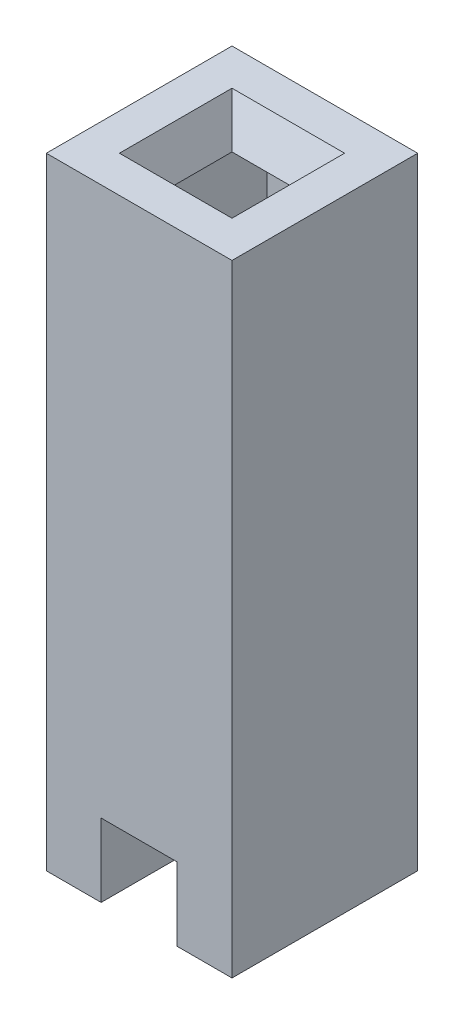
ISO-10303-21;
HEADER;
FILE_DESCRIPTION(('STEP AP214'),'2;1');
FILE_NAME('part.step','',(''),(''),'','','');
FILE_SCHEMA(('AUTOMOTIVE_DESIGN { 1 0 10303 214 1 1 1 1 }'));
ENDSEC;
DATA;
#1=APPLICATION_CONTEXT('core data for automotive mechanical design processes');
#2=APPLICATION_PROTOCOL_DEFINITION('international standard','automotive_design',2000,#1);
#3=PRODUCT_CONTEXT('',#1,'mechanical');
#4=PRODUCT('Part','Part','',(#3));
#5=PRODUCT_RELATED_PRODUCT_CATEGORY('part','',(#4));
#6=PRODUCT_DEFINITION_FORMATION('','',#4);
#7=PRODUCT_DEFINITION_CONTEXT('part definition',#1,'design');
#8=PRODUCT_DEFINITION('design','',#6,#7);
#9=PRODUCT_DEFINITION_SHAPE('','',#8);
#10=(LENGTH_UNIT() NAMED_UNIT(*) SI_UNIT(.MILLI.,.METRE.));
#11=(NAMED_UNIT(*) PLANE_ANGLE_UNIT() SI_UNIT($,.RADIAN.));
#12=(NAMED_UNIT(*) SI_UNIT($,.STERADIAN.) SOLID_ANGLE_UNIT());
#13=UNCERTAINTY_MEASURE_WITH_UNIT(LENGTH_MEASURE(1.E-05),#10,'distance_accuracy_value','');
#14=(GEOMETRIC_REPRESENTATION_CONTEXT(3) GLOBAL_UNCERTAINTY_ASSIGNED_CONTEXT((#13)) GLOBAL_UNIT_ASSIGNED_CONTEXT((#10,
#11,#12)) REPRESENTATION_CONTEXT('',''));
#15=CARTESIAN_POINT('',(0.,0.,0.));
#16=DIRECTION('',(0.,0.,1.));
#17=DIRECTION('',(1.,0.,0.));
#18=AXIS2_PLACEMENT_3D('',#15,#16,#17);
#19=CARTESIAN_POINT('',(-0.75,1.,2.54));
#20=DIRECTION('',(0.,1.,0.));
#21=DIRECTION('',(-1.,0.,0.));
#22=AXIS2_PLACEMENT_3D('',#19,#20,#21);
#23=PLANE('',#22);
#24=DIRECTION('',(0.,0.,-1.));
#25=VECTOR('',#24,1.);
#26=CARTESIAN_POINT('',(-1.79,1.,2.54));
#27=LINE('',#26,#25);
#28=CARTESIAN_POINT('',(-1.79,1.,2.54));
#29=VERTEX_POINT('',#28);
#30=CARTESIAN_POINT('',(-1.79,1.,2.27));
#31=VERTEX_POINT('',#30);
#32=EDGE_CURVE('E302',#29,#31,#27,.T.);
#33=ORIENTED_EDGE('',*,*,#32,.T.);
#34=DIRECTION('',(-1.,0.,0.));
#35=VECTOR('',#34,1.);
#36=CARTESIAN_POINT('',(-1.79,1.,2.27));
#37=LINE('',#36,#35);
#38=CARTESIAN_POINT('',(-0.75,1.,2.27));
#39=VERTEX_POINT('',#38);
#40=EDGE_CURVE('E220',#39,#31,#37,.T.);
#41=ORIENTED_EDGE('',*,*,#40,.F.);
#42=DIRECTION('',(0.,0.,-1.));
#43=VECTOR('',#42,1.);
#44=CARTESIAN_POINT('',(-0.75,1.,2.54));
#45=LINE('',#44,#43);
#46=CARTESIAN_POINT('',(-0.75,1.,2.54));
#47=VERTEX_POINT('',#46);
#48=EDGE_CURVE('E297',#47,#39,#45,.T.);
#49=ORIENTED_EDGE('',*,*,#48,.F.);
#50=DIRECTION('',(1.,0.,0.));
#51=VECTOR('',#50,1.);
#52=CARTESIAN_POINT('',(-0.75,1.,2.54));
#53=LINE('',#52,#51);
#54=EDGE_CURVE('E255',#29,#47,#53,.T.);
#55=ORIENTED_EDGE('',*,*,#54,.F.);
#56=EDGE_LOOP('',(#33,#41,#49,#55));
#57=FACE_BOUND('',#56,.T.);
#58=ADVANCED_FACE('F41',(#57),#23,.F.);
#59=CARTESIAN_POINT('',(0.,0.,2.54));
#60=DIRECTION('',(-1.,0.,0.));
#61=DIRECTION('',(0.,-1.,0.));
#62=AXIS2_PLACEMENT_3D('',#59,#60,#61);
#63=PLANE('',#62);
#64=DIRECTION('',(0.,1.,0.));
#65=VECTOR('',#64,1.);
#66=CARTESIAN_POINT('',(0.,0.,0.));
#67=LINE('',#66,#65);
#68=CARTESIAN_POINT('',(0.,0.,0.));
#69=VERTEX_POINT('',#68);
#70=CARTESIAN_POINT('',(0.,8.5,0.));
#71=VERTEX_POINT('',#70);
#72=EDGE_CURVE('E237',#69,#71,#67,.T.);
#73=ORIENTED_EDGE('',*,*,#72,.T.);
#74=DIRECTION('',(0.,0.,-1.));
#75=VECTOR('',#74,1.);
#76=CARTESIAN_POINT('',(0.,8.5,2.54));
#77=LINE('',#76,#75);
#78=CARTESIAN_POINT('',(0.,8.5,2.54));
#79=VERTEX_POINT('',#78);
#80=EDGE_CURVE('E12',#79,#71,#77,.T.);
#81=ORIENTED_EDGE('',*,*,#80,.F.);
#82=DIRECTION('',(0.,1.,0.));
#83=VECTOR('',#82,1.);
#84=CARTESIAN_POINT('',(0.,0.,2.54));
#85=LINE('',#84,#83);
#86=CARTESIAN_POINT('',(0.,0.,2.54));
#87=VERTEX_POINT('',#86);
#88=EDGE_CURVE('E238',#87,#79,#85,.T.);
#89=ORIENTED_EDGE('',*,*,#88,.F.);
#90=DIRECTION('',(0.,0.,-1.));
#91=VECTOR('',#90,1.);
#92=CARTESIAN_POINT('',(0.,0.,2.54));
#93=LINE('',#92,#91);
#94=EDGE_CURVE('E263',#87,#69,#93,.T.);
#95=ORIENTED_EDGE('',*,*,#94,.T.);
#96=EDGE_LOOP('',(#73,#81,#89,#95));
#97=FACE_BOUND('',#96,.T.);
#98=ADVANCED_FACE('F43',(#97),#63,.F.);
#99=CARTESIAN_POINT('',(0.,8.5,2.54));
#100=DIRECTION('',(0.,-1.,0.));
#101=DIRECTION('',(0.,0.,-1.));
#102=AXIS2_PLACEMENT_3D('',#99,#100,#101);
#103=PLANE('',#102);
#104=DIRECTION('',(-1.,0.,0.));
#105=VECTOR('',#104,1.);
#106=CARTESIAN_POINT('',(-0.5,8.5,0.5));
#107=LINE('',#106,#105);
#108=CARTESIAN_POINT('',(-0.5,8.5,0.5));
#109=VERTEX_POINT('',#108);
#110=CARTESIAN_POINT('',(-2.04,8.5,0.5));
#111=VERTEX_POINT('',#110);
#112=EDGE_CURVE('E180',#109,#111,#107,.T.);
#113=ORIENTED_EDGE('',*,*,#112,.F.);
#114=DIRECTION('',(0.,0.,-1.));
#115=VECTOR('',#114,1.);
#116=CARTESIAN_POINT('',(-0.5,8.5,2.04));
#117=LINE('',#116,#115);
#118=CARTESIAN_POINT('',(-0.5,8.5,2.04));
#119=VERTEX_POINT('',#118);
#120=EDGE_CURVE('E57',#119,#109,#117,.T.);
#121=ORIENTED_EDGE('',*,*,#120,.F.);
#122=DIRECTION('',(1.,0.,0.));
#123=VECTOR('',#122,1.);
#124=CARTESIAN_POINT('',(-2.04,8.5,2.04));
#125=LINE('',#124,#123);
#126=CARTESIAN_POINT('',(-2.04,8.5,2.04));
#127=VERTEX_POINT('',#126);
#128=EDGE_CURVE('E166',#127,#119,#125,.T.);
#129=ORIENTED_EDGE('',*,*,#128,.F.);
#130=DIRECTION('',(0.,0.,1.));
#131=VECTOR('',#130,1.);
#132=CARTESIAN_POINT('',(-2.04,8.5,0.5));
#133=LINE('',#132,#131);
#134=EDGE_CURVE('E175',#111,#127,#133,.T.);
#135=ORIENTED_EDGE('',*,*,#134,.F.);
#136=EDGE_LOOP('',(#113,#121,#129,#135));
#137=FACE_BOUND('',#136,.T.);
#138=DIRECTION('',(-1.,0.,0.));
#139=VECTOR('',#138,1.);
#140=CARTESIAN_POINT('',(0.,8.5,0.));
#141=LINE('',#140,#139);
#142=CARTESIAN_POINT('',(-2.54,8.5,0.));
#143=VERTEX_POINT('',#142);
#144=EDGE_CURVE('E267',#71,#143,#141,.T.);
#145=ORIENTED_EDGE('',*,*,#144,.T.);
#146=DIRECTION('',(0.,0.,-1.));
#147=VECTOR('',#146,1.);
#148=CARTESIAN_POINT('',(-2.54,8.5,2.54));
#149=LINE('',#148,#147);
#150=CARTESIAN_POINT('',(-2.54,8.5,2.54));
#151=VERTEX_POINT('',#150);
#152=EDGE_CURVE('E50',#151,#143,#149,.T.);
#153=ORIENTED_EDGE('',*,*,#152,.F.);
#154=DIRECTION('',(-1.,0.,0.));
#155=VECTOR('',#154,1.);
#156=CARTESIAN_POINT('',(0.,8.5,2.54));
#157=LINE('',#156,#155);
#158=EDGE_CURVE('E242',#79,#151,#157,.T.);
#159=ORIENTED_EDGE('',*,*,#158,.F.);
#160=ORIENTED_EDGE('',*,*,#80,.T.);
#161=EDGE_LOOP('',(#145,#153,#159,#160));
#162=FACE_BOUND('',#161,.T.);
#163=ADVANCED_FACE('F178',(#137,#162),#103,.F.);
#164=CARTESIAN_POINT('',(-2.54,0.,2.54));
#165=DIRECTION('',(1.,0.,0.));
#166=DIRECTION('',(0.,0.,-1.));
#167=AXIS2_PLACEMENT_3D('',#164,#165,#166);
#168=PLANE('',#167);
#169=DIRECTION('',(0.,-1.,0.));
#170=VECTOR('',#169,1.);
#171=CARTESIAN_POINT('',(-2.54,0.,0.));
#172=LINE('',#171,#170);
#173=CARTESIAN_POINT('',(-2.54,0.,0.));
#174=VERTEX_POINT('',#173);
#175=EDGE_CURVE('E270',#143,#174,#172,.T.);
#176=ORIENTED_EDGE('',*,*,#175,.T.);
#177=DIRECTION('',(0.,0.,-1.));
#178=VECTOR('',#177,1.);
#179=CARTESIAN_POINT('',(-2.54,0.,2.54));
#180=LINE('',#179,#178);
#181=CARTESIAN_POINT('',(-2.54,0.,2.54));
#182=VERTEX_POINT('',#181);
#183=EDGE_CURVE('E310',#182,#174,#180,.T.);
#184=ORIENTED_EDGE('',*,*,#183,.F.);
#185=DIRECTION('',(0.,-1.,0.));
#186=VECTOR('',#185,1.);
#187=CARTESIAN_POINT('',(-2.54,0.,2.54));
#188=LINE('',#187,#186);
#189=EDGE_CURVE('E246',#151,#182,#188,.T.);
#190=ORIENTED_EDGE('',*,*,#189,.F.);
#191=ORIENTED_EDGE('',*,*,#152,.T.);
#192=EDGE_LOOP('',(#176,#184,#190,#191));
#193=FACE_BOUND('',#192,.T.);
#194=ADVANCED_FACE('F319',(#193),#168,.F.);
#195=CARTESIAN_POINT('',(-1.79,0.,2.54));
#196=DIRECTION('',(0.,1.,0.));
#197=DIRECTION('',(-1.,0.,0.));
#198=AXIS2_PLACEMENT_3D('',#195,#196,#197);
#199=PLANE('',#198);
#200=DIRECTION('',(1.,0.,0.));
#201=VECTOR('',#200,1.);
#202=CARTESIAN_POINT('',(-1.79,0.,0.));
#203=LINE('',#202,#201);
#204=CARTESIAN_POINT('',(-1.79,0.,0.));
#205=VERTEX_POINT('',#204);
#206=EDGE_CURVE('E273',#174,#205,#203,.T.);
#207=ORIENTED_EDGE('',*,*,#206,.T.);
#208=DIRECTION('',(0.,0.,-1.));
#209=VECTOR('',#208,1.);
#210=CARTESIAN_POINT('',(-1.79,0.,2.54));
#211=LINE('',#210,#209);
#212=CARTESIAN_POINT('',(-1.79,0.,2.54));
#213=VERTEX_POINT('',#212);
#214=EDGE_CURVE('E306',#213,#205,#211,.T.);
#215=ORIENTED_EDGE('',*,*,#214,.F.);
#216=DIRECTION('',(1.,0.,0.));
#217=VECTOR('',#216,1.);
#218=CARTESIAN_POINT('',(-1.79,0.,2.54));
#219=LINE('',#218,#217);
#220=EDGE_CURVE('E249',#182,#213,#219,.T.);
#221=ORIENTED_EDGE('',*,*,#220,.F.);
#222=ORIENTED_EDGE('',*,*,#183,.T.);
#223=EDGE_LOOP('',(#207,#215,#221,#222));
#224=FACE_BOUND('',#223,.T.);
#225=ADVANCED_FACE('F329',(#224),#199,.F.);
#226=CARTESIAN_POINT('',(-1.79,0.,2.54));
#227=DIRECTION('',(-1.,0.,0.));
#228=DIRECTION('',(0.,0.,1.));
#229=AXIS2_PLACEMENT_3D('',#226,#227,#228);
#230=PLANE('',#229);
#231=DIRECTION('',(0.,1.,0.));
#232=VECTOR('',#231,1.);
#233=CARTESIAN_POINT('',(-1.79,0.,0.));
#234=LINE('',#233,#232);
#235=CARTESIAN_POINT('',(-1.79,1.,0.));
#236=VERTEX_POINT('',#235);
#237=EDGE_CURVE('E276',#205,#236,#234,.T.);
#238=ORIENTED_EDGE('',*,*,#237,.T.);
#239=CARTESIAN_POINT('',(-1.79,1.,0.27));
#240=VERTEX_POINT('',#239);
#241=EDGE_CURVE('E301',#240,#236,#27,.T.);
#242=ORIENTED_EDGE('',*,*,#241,.F.);
#243=DIRECTION('',(0.,-1.,0.));
#244=VECTOR('',#243,1.);
#245=CARTESIAN_POINT('',(-1.79,10.7542404485769,0.27));
#246=LINE('',#245,#244);
#247=CARTESIAN_POINT('',(-1.79,8.,0.27));
#248=VERTEX_POINT('',#247);
#249=EDGE_CURVE('E224',#248,#240,#246,.T.);
#250=ORIENTED_EDGE('',*,*,#249,.F.);
#251=DIRECTION('',(0.,0.,1.));
#252=VECTOR('',#251,1.);
#253=CARTESIAN_POINT('',(-1.79,8.,2.27));
#254=LINE('',#253,#252);
#255=CARTESIAN_POINT('',(-1.79,8.,2.27));
#256=VERTEX_POINT('',#255);
#257=EDGE_CURVE('E214',#248,#256,#254,.T.);
#258=ORIENTED_EDGE('',*,*,#257,.T.);
#259=DIRECTION('',(0.,-1.,0.));
#260=VECTOR('',#259,1.);
#261=CARTESIAN_POINT('',(-1.79,10.7542404485769,2.27));
#262=LINE('',#261,#260);
#263=EDGE_CURVE('E211',#256,#31,#262,.T.);
#264=ORIENTED_EDGE('',*,*,#263,.T.);
#265=ORIENTED_EDGE('',*,*,#32,.F.);
#266=DIRECTION('',(0.,1.,0.));
#267=VECTOR('',#266,1.);
#268=CARTESIAN_POINT('',(-1.79,0.,2.54));
#269=LINE('',#268,#267);
#270=EDGE_CURVE('E252',#213,#29,#269,.T.);
#271=ORIENTED_EDGE('',*,*,#270,.F.);
#272=ORIENTED_EDGE('',*,*,#214,.T.);
#273=EDGE_LOOP('',(#238,#242,#250,#258,#264,#265,#271,#272));
#274=FACE_BOUND('',#273,.T.);
#275=ADVANCED_FACE('F333',(#274),#230,.F.);
#276=CARTESIAN_POINT('',(-0.75,1.,0.27));
#277=VERTEX_POINT('',#276);
#278=CARTESIAN_POINT('',(-0.75,1.,0.));
#279=VERTEX_POINT('',#278);
#280=EDGE_CURVE('E296',#277,#279,#45,.T.);
#281=ORIENTED_EDGE('',*,*,#280,.F.);
#282=DIRECTION('',(1.,0.,0.));
#283=VECTOR('',#282,1.);
#284=CARTESIAN_POINT('',(-1.79,1.,0.27));
#285=LINE('',#284,#283);
#286=EDGE_CURVE('E174',#240,#277,#285,.T.);
#287=ORIENTED_EDGE('',*,*,#286,.F.);
#288=ORIENTED_EDGE('',*,*,#241,.T.);
#289=DIRECTION('',(1.,0.,0.));
#290=VECTOR('',#289,1.);
#291=CARTESIAN_POINT('',(-0.75,1.,0.));
#292=LINE('',#291,#290);
#293=EDGE_CURVE('E280',#236,#279,#292,.T.);
#294=ORIENTED_EDGE('',*,*,#293,.T.);
#295=EDGE_LOOP('',(#281,#287,#288,#294));
#296=FACE_BOUND('',#295,.T.);
#297=ADVANCED_FACE('F358',(#296),#23,.F.);
#298=CARTESIAN_POINT('',(-0.75,0.,2.54));
#299=DIRECTION('',(1.,0.,0.));
#300=DIRECTION('',(0.,0.,-1.));
#301=AXIS2_PLACEMENT_3D('',#298,#299,#300);
#302=PLANE('',#301);
#303=DIRECTION('',(0.,-1.,0.));
#304=VECTOR('',#303,1.);
#305=CARTESIAN_POINT('',(-0.75,0.,0.));
#306=LINE('',#305,#304);
#307=CARTESIAN_POINT('',(-0.75,0.,0.));
#308=VERTEX_POINT('',#307);
#309=EDGE_CURVE('E284',#279,#308,#306,.T.);
#310=ORIENTED_EDGE('',*,*,#309,.T.);
#311=DIRECTION('',(0.,0.,-1.));
#312=VECTOR('',#311,1.);
#313=CARTESIAN_POINT('',(-0.75,0.,2.54));
#314=LINE('',#313,#312);
#315=CARTESIAN_POINT('',(-0.75,0.,2.54));
#316=VERTEX_POINT('',#315);
#317=EDGE_CURVE('E292',#316,#308,#314,.T.);
#318=ORIENTED_EDGE('',*,*,#317,.F.);
#319=DIRECTION('',(0.,-1.,0.));
#320=VECTOR('',#319,1.);
#321=CARTESIAN_POINT('',(-0.75,0.,2.54));
#322=LINE('',#321,#320);
#323=EDGE_CURVE('E258',#47,#316,#322,.T.);
#324=ORIENTED_EDGE('',*,*,#323,.F.);
#325=ORIENTED_EDGE('',*,*,#48,.T.);
#326=DIRECTION('',(0.,-1.,0.));
#327=VECTOR('',#326,1.);
#328=CARTESIAN_POINT('',(-0.750000000000002,10.7542404485769,2.27));
#329=LINE('',#328,#327);
#330=CARTESIAN_POINT('',(-0.750000000000002,8.,2.27));
#331=VERTEX_POINT('',#330);
#332=EDGE_CURVE('E226',#331,#39,#329,.T.);
#333=ORIENTED_EDGE('',*,*,#332,.F.);
#334=DIRECTION('',(0.,0.,-1.));
#335=VECTOR('',#334,1.);
#336=CARTESIAN_POINT('',(-0.750000000000002,8.,2.27));
#337=LINE('',#336,#335);
#338=CARTESIAN_POINT('',(-0.750000000000002,8.,0.27));
#339=VERTEX_POINT('',#338);
#340=EDGE_CURVE('E207',#331,#339,#337,.T.);
#341=ORIENTED_EDGE('',*,*,#340,.T.);
#342=DIRECTION('',(0.,-1.,0.));
#343=VECTOR('',#342,1.);
#344=CARTESIAN_POINT('',(-0.750000000000002,10.7542404485769,0.27));
#345=LINE('',#344,#343);
#346=EDGE_CURVE('E229',#339,#277,#345,.T.);
#347=ORIENTED_EDGE('',*,*,#346,.T.);
#348=ORIENTED_EDGE('',*,*,#280,.T.);
#349=EDGE_LOOP('',(#310,#318,#324,#325,#333,#341,#347,#348));
#350=FACE_BOUND('',#349,.T.);
#351=ADVANCED_FACE('F352',(#350),#302,.F.);
#352=CARTESIAN_POINT('',(0.,0.,2.54));
#353=DIRECTION('',(0.,1.,0.));
#354=DIRECTION('',(-1.,0.,0.));
#355=AXIS2_PLACEMENT_3D('',#352,#353,#354);
#356=PLANE('',#355);
#357=DIRECTION('',(1.,0.,0.));
#358=VECTOR('',#357,1.);
#359=CARTESIAN_POINT('',(0.,0.,0.));
#360=LINE('',#359,#358);
#361=EDGE_CURVE('E243',#308,#69,#360,.T.);
#362=ORIENTED_EDGE('',*,*,#361,.T.);
#363=ORIENTED_EDGE('',*,*,#94,.F.);
#364=DIRECTION('',(1.,0.,0.));
#365=VECTOR('',#364,1.);
#366=CARTESIAN_POINT('',(0.,0.,2.54));
#367=LINE('',#366,#365);
#368=EDGE_CURVE('E260',#316,#87,#367,.T.);
#369=ORIENTED_EDGE('',*,*,#368,.F.);
#370=ORIENTED_EDGE('',*,*,#317,.T.);
#371=EDGE_LOOP('',(#362,#363,#369,#370));
#372=FACE_BOUND('',#371,.T.);
#373=ADVANCED_FACE('F347',(#372),#356,.F.);
#374=CARTESIAN_POINT('',(0.,0.,2.54));
#375=DIRECTION('',(0.,0.,1.));
#376=DIRECTION('',(1.,0.,0.));
#377=AXIS2_PLACEMENT_3D('',#374,#375,#376);
#378=PLANE('',#377);
#379=ORIENTED_EDGE('',*,*,#88,.T.);
#380=ORIENTED_EDGE('',*,*,#158,.T.);
#381=ORIENTED_EDGE('',*,*,#189,.T.);
#382=ORIENTED_EDGE('',*,*,#220,.T.);
#383=ORIENTED_EDGE('',*,*,#270,.T.);
#384=ORIENTED_EDGE('',*,*,#54,.T.);
#385=ORIENTED_EDGE('',*,*,#323,.T.);
#386=ORIENTED_EDGE('',*,*,#368,.T.);
#387=EDGE_LOOP('',(#379,#380,#381,#382,#383,#384,#385,#386));
#388=FACE_BOUND('',#387,.T.);
#389=ADVANCED_FACE('F338',(#388),#378,.T.);
#390=CARTESIAN_POINT('',(0.,0.,0.));
#391=DIRECTION('',(0.,0.,1.));
#392=DIRECTION('',(1.,0.,0.));
#393=AXIS2_PLACEMENT_3D('',#390,#391,#392);
#394=PLANE('',#393);
#395=ORIENTED_EDGE('',*,*,#72,.F.);
#396=ORIENTED_EDGE('',*,*,#361,.F.);
#397=ORIENTED_EDGE('',*,*,#309,.F.);
#398=ORIENTED_EDGE('',*,*,#293,.F.);
#399=ORIENTED_EDGE('',*,*,#237,.F.);
#400=ORIENTED_EDGE('',*,*,#206,.F.);
#401=ORIENTED_EDGE('',*,*,#175,.F.);
#402=ORIENTED_EDGE('',*,*,#144,.F.);
#403=EDGE_LOOP('',(#395,#396,#397,#398,#399,#400,#401,#402));
#404=FACE_BOUND('',#403,.T.);
#405=ADVANCED_FACE('F324',(#404),#394,.F.);
#406=CARTESIAN_POINT('',(-1.79,10.7542404485769,2.27));
#407=DIRECTION('',(0.,0.,1.));
#408=DIRECTION('',(1.,0.,0.));
#409=AXIS2_PLACEMENT_3D('',#406,#407,#408);
#410=PLANE('',#409);
#411=DIRECTION('',(1.,0.,0.));
#412=VECTOR('',#411,1.);
#413=CARTESIAN_POINT('',(-1.79,8.,2.27));
#414=LINE('',#413,#412);
#415=EDGE_CURVE('E210',#256,#331,#414,.T.);
#416=ORIENTED_EDGE('',*,*,#415,.T.);
#417=ORIENTED_EDGE('',*,*,#332,.T.);
#418=ORIENTED_EDGE('',*,*,#40,.T.);
#419=ORIENTED_EDGE('',*,*,#263,.F.);
#420=EDGE_LOOP('',(#416,#417,#418,#419));
#421=FACE_BOUND('',#420,.T.);
#422=ADVANCED_FACE('F378',(#421),#410,.F.);
#423=CARTESIAN_POINT('',(-1.79,10.7542404485769,0.27));
#424=DIRECTION('',(0.,0.,-1.));
#425=DIRECTION('',(-1.,0.,0.));
#426=AXIS2_PLACEMENT_3D('',#423,#424,#425);
#427=PLANE('',#426);
#428=DIRECTION('',(-1.,0.,0.));
#429=VECTOR('',#428,1.);
#430=CARTESIAN_POINT('',(-1.79,8.,0.27));
#431=LINE('',#430,#429);
#432=EDGE_CURVE('E217',#339,#248,#431,.T.);
#433=ORIENTED_EDGE('',*,*,#432,.T.);
#434=ORIENTED_EDGE('',*,*,#249,.T.);
#435=ORIENTED_EDGE('',*,*,#286,.T.);
#436=ORIENTED_EDGE('',*,*,#346,.F.);
#437=EDGE_LOOP('',(#433,#434,#435,#436));
#438=FACE_BOUND('',#437,.T.);
#439=ADVANCED_FACE('F369',(#438),#427,.F.);
#440=CARTESIAN_POINT('',(0.,8.,2.54));
#441=DIRECTION('',(0.,-1.,0.));
#442=DIRECTION('',(0.,0.,-1.));
#443=AXIS2_PLACEMENT_3D('',#440,#441,#442);
#444=PLANE('',#443);
#445=DIRECTION('',(0.,0.,-1.));
#446=VECTOR('',#445,1.);
#447=CARTESIAN_POINT('',(-0.754762724747216,8.,2.04));
#448=LINE('',#447,#446);
#449=CARTESIAN_POINT('',(-0.754762724747216,8.,1.78523727525278));
#450=VERTEX_POINT('',#449);
#451=CARTESIAN_POINT('',(-0.754762724747216,8.,0.754762724747215));
#452=VERTEX_POINT('',#451);
#453=EDGE_CURVE('E158',#450,#452,#448,.T.);
#454=ORIENTED_EDGE('',*,*,#453,.T.);
#455=DIRECTION('',(-1.,0.,0.));
#456=VECTOR('',#455,1.);
#457=CARTESIAN_POINT('',(-0.5,8.,0.754762724747215));
#458=LINE('',#457,#456);
#459=CARTESIAN_POINT('',(-1.78523727525278,8.,0.754762724747215));
#460=VERTEX_POINT('',#459);
#461=EDGE_CURVE('E188',#452,#460,#458,.T.);
#462=ORIENTED_EDGE('',*,*,#461,.T.);
#463=DIRECTION('',(0.,0.,1.));
#464=VECTOR('',#463,1.);
#465=CARTESIAN_POINT('',(-1.78523727525279,8.,0.5));
#466=LINE('',#465,#464);
#467=CARTESIAN_POINT('',(-1.78523727525279,8.,1.78523727525278));
#468=VERTEX_POINT('',#467);
#469=EDGE_CURVE('E162',#460,#468,#466,.T.);
#470=ORIENTED_EDGE('',*,*,#469,.T.);
#471=DIRECTION('',(1.,0.,0.));
#472=VECTOR('',#471,1.);
#473=CARTESIAN_POINT('',(-2.04,8.,1.78523727525278));
#474=LINE('',#473,#472);
#475=EDGE_CURVE('E163',#468,#450,#474,.T.);
#476=ORIENTED_EDGE('',*,*,#475,.T.);
#477=EDGE_LOOP('',(#454,#462,#470,#476));
#478=FACE_BOUND('',#477,.T.);
#479=ORIENTED_EDGE('',*,*,#257,.F.);
#480=ORIENTED_EDGE('',*,*,#432,.F.);
#481=ORIENTED_EDGE('',*,*,#340,.F.);
#482=ORIENTED_EDGE('',*,*,#415,.F.);
#483=EDGE_LOOP('',(#479,#480,#481,#482));
#484=FACE_BOUND('',#483,.T.);
#485=ADVANCED_FACE('F366',(#478,#484),#444,.T.);
#486=CARTESIAN_POINT('',(-0.5,8.5,2.04));
#487=DIRECTION('',(0.891006524188367,-0.453990499739548,0.));
#488=DIRECTION('',(0.453990499739548,0.891006524188367,0.));
#489=AXIS2_PLACEMENT_3D('',#486,#487,#488);
#490=PLANE('',#489);
#491=DIRECTION('',(0.413384109704205,0.811311996514364,0.413384109704205));
#492=VECTOR('',#491,1.);
#493=CARTESIAN_POINT('',(-0.763165090120145,7.983509429448,1.77683490987986));
#494=LINE('',#493,#492);
#495=EDGE_CURVE('E154',#450,#119,#494,.T.);
#496=ORIENTED_EDGE('',*,*,#495,.T.);
#497=ORIENTED_EDGE('',*,*,#120,.T.);
#498=DIRECTION('',(0.413384109704205,0.811311996514364,-0.413384109704205));
#499=VECTOR('',#498,1.);
#500=CARTESIAN_POINT('',(-0.763165090120145,7.983509429448,0.763165090120145));
#501=LINE('',#500,#499);
#502=EDGE_CURVE('E197',#452,#109,#501,.T.);
#503=ORIENTED_EDGE('',*,*,#502,.F.);
#504=ORIENTED_EDGE('',*,*,#453,.F.);
#505=EDGE_LOOP('',(#496,#497,#503,#504));
#506=FACE_BOUND('',#505,.T.);
#507=ADVANCED_FACE('F156',(#506),#490,.F.);
#508=CARTESIAN_POINT('',(-2.04,8.5,2.04));
#509=DIRECTION('',(0.,-0.453990499739548,0.891006524188367));
#510=DIRECTION('',(0.,-0.891006524188367,-0.453990499739548));
#511=AXIS2_PLACEMENT_3D('',#508,#509,#510);
#512=PLANE('',#511);
#513=DIRECTION('',(-0.413384109704205,0.811311996514364,0.413384109704205));
#514=VECTOR('',#513,1.);
#515=CARTESIAN_POINT('',(-1.77683490987986,7.983509429448,1.77683490987986));
#516=LINE('',#515,#514);
#517=EDGE_CURVE('E169',#468,#127,#516,.T.);
#518=ORIENTED_EDGE('',*,*,#517,.T.);
#519=ORIENTED_EDGE('',*,*,#128,.T.);
#520=ORIENTED_EDGE('',*,*,#495,.F.);
#521=ORIENTED_EDGE('',*,*,#475,.F.);
#522=EDGE_LOOP('',(#518,#519,#520,#521));
#523=FACE_BOUND('',#522,.T.);
#524=ADVANCED_FACE('F167',(#523),#512,.F.);
#525=CARTESIAN_POINT('',(-2.04,8.5,0.5));
#526=DIRECTION('',(-0.891006524188367,-0.453990499739548,0.));
#527=DIRECTION('',(0.453990499739548,-0.891006524188367,0.));
#528=AXIS2_PLACEMENT_3D('',#525,#526,#527);
#529=PLANE('',#528);
#530=DIRECTION('',(-0.413384109704205,0.811311996514364,-0.413384109704205));
#531=VECTOR('',#530,1.);
#532=CARTESIAN_POINT('',(-1.77683490987986,7.983509429448,0.763165090120145));
#533=LINE('',#532,#531);
#534=EDGE_CURVE('E65',#460,#111,#533,.T.);
#535=ORIENTED_EDGE('',*,*,#534,.T.);
#536=ORIENTED_EDGE('',*,*,#134,.T.);
#537=ORIENTED_EDGE('',*,*,#517,.F.);
#538=ORIENTED_EDGE('',*,*,#469,.F.);
#539=EDGE_LOOP('',(#535,#536,#537,#538));
#540=FACE_BOUND('',#539,.T.);
#541=ADVANCED_FACE('F363',(#540),#529,.F.);
#542=CARTESIAN_POINT('',(-0.5,8.5,0.5));
#543=DIRECTION('',(0.,-0.453990499739548,-0.891006524188367));
#544=DIRECTION('',(0.,0.891006524188367,-0.453990499739548));
#545=AXIS2_PLACEMENT_3D('',#542,#543,#544);
#546=PLANE('',#545);
#547=ORIENTED_EDGE('',*,*,#502,.T.);
#548=ORIENTED_EDGE('',*,*,#112,.T.);
#549=ORIENTED_EDGE('',*,*,#534,.F.);
#550=ORIENTED_EDGE('',*,*,#461,.F.);
#551=EDGE_LOOP('',(#547,#548,#549,#550));
#552=FACE_BOUND('',#551,.T.);
#553=ADVANCED_FACE('F364',(#552),#546,.F.);
#554=CLOSED_SHELL('',(#58,#98,#163,#194,#225,#275,#297,#351,#373,#389,#405,#422,#439,#485,#507,
#524,#541,#553));
#555=MANIFOLD_SOLID_BREP('B2',#554);
#556=ADVANCED_BREP_SHAPE_REPRESENTATION('',(#18,#555),#14);
#557=SHAPE_DEFINITION_REPRESENTATION(#9,#556);
ENDSEC;
END-ISO-10303-21;
